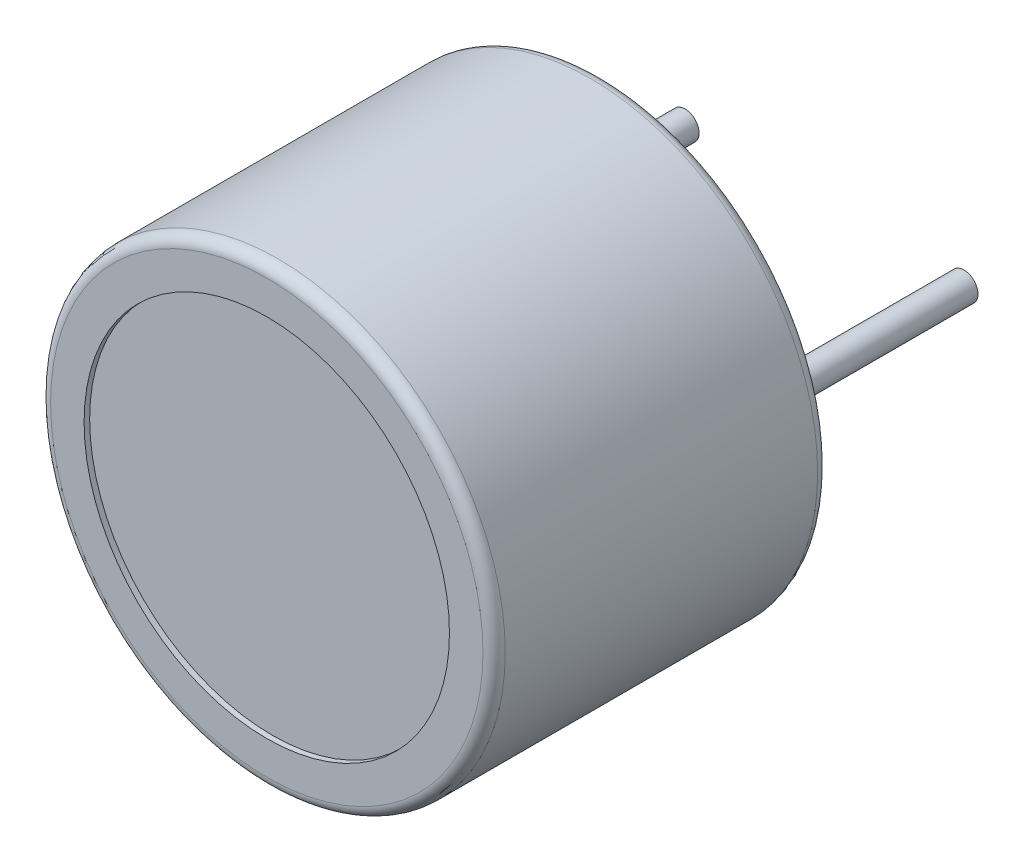
ISO-10303-21;
HEADER;
FILE_DESCRIPTION(('STEP AP214'),'2;1');
FILE_NAME('part.step','',(''),(''),'','','');
FILE_SCHEMA(('AUTOMOTIVE_DESIGN { 1 0 10303 214 1 1 1 1 }'));
ENDSEC;
DATA;
#1=APPLICATION_CONTEXT('core data for automotive mechanical design processes');
#2=APPLICATION_PROTOCOL_DEFINITION('international standard','automotive_design',2000,#1);
#3=PRODUCT_CONTEXT('',#1,'mechanical');
#4=PRODUCT('Part','Part','',(#3));
#5=PRODUCT_RELATED_PRODUCT_CATEGORY('part','',(#4));
#6=PRODUCT_DEFINITION_FORMATION('','',#4);
#7=PRODUCT_DEFINITION_CONTEXT('part definition',#1,'design');
#8=PRODUCT_DEFINITION('design','',#6,#7);
#9=PRODUCT_DEFINITION_SHAPE('','',#8);
#10=(LENGTH_UNIT() NAMED_UNIT(*) SI_UNIT(.MILLI.,.METRE.));
#11=(NAMED_UNIT(*) PLANE_ANGLE_UNIT() SI_UNIT($,.RADIAN.));
#12=(NAMED_UNIT(*) SI_UNIT($,.STERADIAN.) SOLID_ANGLE_UNIT());
#13=UNCERTAINTY_MEASURE_WITH_UNIT(LENGTH_MEASURE(1.E-05),#10,'distance_accuracy_value','');
#14=(GEOMETRIC_REPRESENTATION_CONTEXT(3) GLOBAL_UNCERTAINTY_ASSIGNED_CONTEXT((#13)) GLOBAL_UNIT_ASSIGNED_CONTEXT((#10,
#11,#12)) REPRESENTATION_CONTEXT('',''));
#15=CARTESIAN_POINT('',(0.,0.,0.));
#16=DIRECTION('',(0.,0.,1.));
#17=DIRECTION('',(1.,0.,0.));
#18=AXIS2_PLACEMENT_3D('',#15,#16,#17);
#19=CARTESIAN_POINT('',(0.,0.,0.));
#20=DIRECTION('',(0.,0.,1.));
#21=DIRECTION('',(1.,0.,0.));
#22=AXIS2_PLACEMENT_3D('',#19,#20,#21);
#23=PLANE('',#22);
#24=CARTESIAN_POINT('',(-5.,0.,0.));
#25=DIRECTION('',(0.,0.,1.));
#26=DIRECTION('',(1.,0.,0.));
#27=AXIS2_PLACEMENT_3D('',#24,#25,#26);
#28=CIRCLE('',#27,0.9);
#29=CARTESIAN_POINT('',(-4.1,0.,0.));
#30=VERTEX_POINT('',#29);
#31=EDGE_CURVE('E50',#30,#30,#28,.T.);
#32=ORIENTED_EDGE('',*,*,#31,.T.);
#33=EDGE_LOOP('',(#32));
#34=FACE_BOUND('',#33,.T.);
#35=CARTESIAN_POINT('',(5.,0.,0.));
#36=DIRECTION('',(0.,0.,1.));
#37=DIRECTION('',(1.,0.,0.));
#38=AXIS2_PLACEMENT_3D('',#35,#36,#37);
#39=CIRCLE('',#38,0.9);
#40=CARTESIAN_POINT('',(5.9,0.,0.));
#41=VERTEX_POINT('',#40);
#42=EDGE_CURVE('E53',#41,#41,#39,.T.);
#43=ORIENTED_EDGE('',*,*,#42,.T.);
#44=EDGE_LOOP('',(#43));
#45=FACE_BOUND('',#44,.T.);
#46=CARTESIAN_POINT('',(0.,0.,0.));
#47=DIRECTION('',(0.,0.,1.));
#48=DIRECTION('',(1.,0.,0.));
#49=AXIS2_PLACEMENT_3D('',#46,#47,#48);
#50=CIRCLE('',#49,7.75);
#51=CARTESIAN_POINT('',(7.75,0.,0.));
#52=VERTEX_POINT('',#51);
#53=EDGE_CURVE('E56',#52,#52,#50,.F.);
#54=ORIENTED_EDGE('',*,*,#53,.T.);
#55=EDGE_LOOP('',(#54));
#56=FACE_BOUND('',#55,.T.);
#57=ADVANCED_FACE('F30',(#34,#45,#56),#23,.F.);
#58=CARTESIAN_POINT('',(0.,0.,12.));
#59=DIRECTION('',(0.,0.,-1.));
#60=DIRECTION('',(-1.,0.,0.));
#61=AXIS2_PLACEMENT_3D('',#58,#59,#60);
#62=CYLINDRICAL_SURFACE('',#61,8.15);
#63=CARTESIAN_POINT('',(0.,0.,0.399999999999999));
#64=DIRECTION('',(0.,0.,1.));
#65=DIRECTION('',(1.,0.,0.));
#66=AXIS2_PLACEMENT_3D('',#63,#64,#65);
#67=CIRCLE('',#66,8.15);
#68=CARTESIAN_POINT('',(8.15,0.,0.399999999999999));
#69=VERTEX_POINT('',#68);
#70=EDGE_CURVE('E37',#69,#69,#67,.T.);
#71=ORIENTED_EDGE('',*,*,#70,.T.);
#72=EDGE_LOOP('',(#71));
#73=FACE_BOUND('',#72,.T.);
#74=CARTESIAN_POINT('',(0.,0.,11.6));
#75=DIRECTION('',(0.,0.,1.));
#76=DIRECTION('',(1.,0.,0.));
#77=AXIS2_PLACEMENT_3D('',#74,#75,#76);
#78=CIRCLE('',#77,8.15);
#79=CARTESIAN_POINT('',(8.15,0.,11.6));
#80=VERTEX_POINT('',#79);
#81=EDGE_CURVE('E41',#80,#80,#78,.F.);
#82=ORIENTED_EDGE('',*,*,#81,.T.);
#83=EDGE_LOOP('',(#82));
#84=FACE_BOUND('',#83,.T.);
#85=ADVANCED_FACE('F86',(#73,#84),#62,.T.);
#86=CARTESIAN_POINT('',(0.,0.,12.));
#87=DIRECTION('',(0.,0.,1.));
#88=DIRECTION('',(1.,0.,0.));
#89=AXIS2_PLACEMENT_3D('',#86,#87,#88);
#90=PLANE('',#89);
#91=CARTESIAN_POINT('',(0.,0.,12.));
#92=DIRECTION('',(0.,0.,1.));
#93=DIRECTION('',(1.,0.,0.));
#94=AXIS2_PLACEMENT_3D('',#91,#92,#93);
#95=CIRCLE('',#94,6.55);
#96=CARTESIAN_POINT('',(6.55,0.,12.));
#97=VERTEX_POINT('',#96);
#98=EDGE_CURVE('E69',#97,#97,#95,.T.);
#99=ORIENTED_EDGE('',*,*,#98,.F.);
#100=EDGE_LOOP('',(#99));
#101=FACE_BOUND('',#100,.T.);
#102=CARTESIAN_POINT('',(0.,0.,12.));
#103=DIRECTION('',(0.,0.,1.));
#104=DIRECTION('',(1.,0.,0.));
#105=AXIS2_PLACEMENT_3D('',#102,#103,#104);
#106=CIRCLE('',#105,7.75);
#107=CARTESIAN_POINT('',(7.75,0.,12.));
#108=VERTEX_POINT('',#107);
#109=EDGE_CURVE('E10',#108,#108,#106,.T.);
#110=ORIENTED_EDGE('',*,*,#109,.T.);
#111=EDGE_LOOP('',(#110));
#112=FACE_BOUND('',#111,.T.);
#113=ADVANCED_FACE('F83',(#101,#112),#90,.T.);
#114=CARTESIAN_POINT('',(5.,0.,-8.));
#115=DIRECTION('',(0.,0.,1.));
#116=DIRECTION('',(1.,0.,0.));
#117=AXIS2_PLACEMENT_3D('',#114,#115,#116);
#118=CYLINDRICAL_SURFACE('',#117,0.5);
#119=CARTESIAN_POINT('',(5.,0.,-0.4));
#120=DIRECTION('',(0.,0.,1.));
#121=DIRECTION('',(1.,0.,0.));
#122=AXIS2_PLACEMENT_3D('',#119,#120,#121);
#123=CIRCLE('',#122,0.5);
#124=CARTESIAN_POINT('',(5.5,0.,-0.4));
#125=VERTEX_POINT('',#124);
#126=EDGE_CURVE('E45',#125,#125,#123,.F.);
#127=ORIENTED_EDGE('',*,*,#126,.T.);
#128=EDGE_LOOP('',(#127));
#129=FACE_BOUND('',#128,.T.);
#130=CARTESIAN_POINT('',(5.,0.,-8.));
#131=DIRECTION('',(0.,0.,-1.));
#132=DIRECTION('',(-1.,0.,0.));
#133=AXIS2_PLACEMENT_3D('',#130,#131,#132);
#134=CIRCLE('',#133,0.5);
#135=CARTESIAN_POINT('',(4.5,0.,-8.));
#136=VERTEX_POINT('',#135);
#137=EDGE_CURVE('E62',#136,#136,#134,.T.);
#138=ORIENTED_EDGE('',*,*,#137,.F.);
#139=EDGE_LOOP('',(#138));
#140=FACE_BOUND('',#139,.T.);
#141=ADVANCED_FACE('F85',(#129,#140),#118,.T.);
#142=CARTESIAN_POINT('',(5.,0.,-8.));
#143=DIRECTION('',(0.,0.,-1.));
#144=DIRECTION('',(-1.,0.,0.));
#145=AXIS2_PLACEMENT_3D('',#142,#143,#144);
#146=PLANE('',#145);
#147=ORIENTED_EDGE('',*,*,#137,.T.);
#148=EDGE_LOOP('',(#147));
#149=FACE_BOUND('',#148,.T.);
#150=ADVANCED_FACE('F92',(#149),#146,.T.);
#151=CARTESIAN_POINT('',(-5.,0.,-8.));
#152=DIRECTION('',(0.,0.,1.));
#153=DIRECTION('',(1.,0.,0.));
#154=AXIS2_PLACEMENT_3D('',#151,#152,#153);
#155=CYLINDRICAL_SURFACE('',#154,0.5);
#156=CARTESIAN_POINT('',(-5.,0.,-0.4));
#157=DIRECTION('',(0.,0.,1.));
#158=DIRECTION('',(1.,0.,0.));
#159=AXIS2_PLACEMENT_3D('',#156,#157,#158);
#160=CIRCLE('',#159,0.5);
#161=CARTESIAN_POINT('',(-4.5,0.,-0.4));
#162=VERTEX_POINT('',#161);
#163=EDGE_CURVE('E59',#162,#162,#160,.F.);
#164=ORIENTED_EDGE('',*,*,#163,.T.);
#165=EDGE_LOOP('',(#164));
#166=FACE_BOUND('',#165,.T.);
#167=CARTESIAN_POINT('',(-5.,0.,-8.));
#168=DIRECTION('',(0.,0.,-1.));
#169=DIRECTION('',(1.,0.,0.));
#170=AXIS2_PLACEMENT_3D('',#167,#168,#169);
#171=CIRCLE('',#170,0.5);
#172=CARTESIAN_POINT('',(-4.5,0.,-8.));
#173=VERTEX_POINT('',#172);
#174=EDGE_CURVE('E65',#173,#173,#171,.T.);
#175=ORIENTED_EDGE('',*,*,#174,.F.);
#176=EDGE_LOOP('',(#175));
#177=FACE_BOUND('',#176,.T.);
#178=ADVANCED_FACE('F165',(#166,#177),#155,.T.);
#179=CARTESIAN_POINT('',(-5.,0.,-8.));
#180=DIRECTION('',(0.,0.,1.));
#181=DIRECTION('',(1.,0.,0.));
#182=AXIS2_PLACEMENT_3D('',#179,#180,#181);
#183=PLANE('',#182);
#184=ORIENTED_EDGE('',*,*,#174,.T.);
#185=EDGE_LOOP('',(#184));
#186=FACE_BOUND('',#185,.T.);
#187=ADVANCED_FACE('F107',(#186),#183,.F.);
#188=CARTESIAN_POINT('',(-5.,0.,-0.4));
#189=DIRECTION('',(0.,0.,1.));
#190=DIRECTION('',(1.,0.,0.));
#191=AXIS2_PLACEMENT_3D('',#188,#189,#190);
#192=TOROIDAL_SURFACE('',#191,0.9,0.4);
#193=ORIENTED_EDGE('',*,*,#31,.F.);
#194=EDGE_LOOP('',(#193));
#195=FACE_BOUND('',#194,.T.);
#196=ORIENTED_EDGE('',*,*,#163,.F.);
#197=EDGE_LOOP('',(#196));
#198=FACE_BOUND('',#197,.T.);
#199=ADVANCED_FACE('F103',(#195,#198),#192,.F.);
#200=CARTESIAN_POINT('',(5.,0.,-0.4));
#201=DIRECTION('',(0.,0.,1.));
#202=DIRECTION('',(1.,0.,0.));
#203=AXIS2_PLACEMENT_3D('',#200,#201,#202);
#204=TOROIDAL_SURFACE('',#203,0.9,0.4);
#205=ORIENTED_EDGE('',*,*,#42,.F.);
#206=EDGE_LOOP('',(#205));
#207=FACE_BOUND('',#206,.T.);
#208=ORIENTED_EDGE('',*,*,#126,.F.);
#209=EDGE_LOOP('',(#208));
#210=FACE_BOUND('',#209,.T.);
#211=ADVANCED_FACE('F106',(#207,#210),#204,.F.);
#212=CARTESIAN_POINT('',(0.,0.,0.399999999999999));
#213=DIRECTION('',(0.,0.,1.));
#214=DIRECTION('',(1.,0.,0.));
#215=AXIS2_PLACEMENT_3D('',#212,#213,#214);
#216=TOROIDAL_SURFACE('',#215,7.75,0.4);
#217=ORIENTED_EDGE('',*,*,#53,.F.);
#218=EDGE_LOOP('',(#217));
#219=FACE_BOUND('',#218,.T.);
#220=ORIENTED_EDGE('',*,*,#70,.F.);
#221=EDGE_LOOP('',(#220));
#222=FACE_BOUND('',#221,.T.);
#223=ADVANCED_FACE('F110',(#219,#222),#216,.T.);
#224=CARTESIAN_POINT('',(0.,0.,11.6));
#225=DIRECTION('',(0.,0.,1.));
#226=DIRECTION('',(1.,0.,0.));
#227=AXIS2_PLACEMENT_3D('',#224,#225,#226);
#228=TOROIDAL_SURFACE('',#227,7.75,0.4);
#229=ORIENTED_EDGE('',*,*,#81,.F.);
#230=EDGE_LOOP('',(#229));
#231=FACE_BOUND('',#230,.T.);
#232=ORIENTED_EDGE('',*,*,#109,.F.);
#233=EDGE_LOOP('',(#232));
#234=FACE_BOUND('',#233,.T.);
#235=ADVANCED_FACE('F32',(#231,#234),#228,.T.);
#236=CARTESIAN_POINT('',(0.,0.,11.8));
#237=DIRECTION('',(0.,0.,1.));
#238=DIRECTION('',(1.,0.,0.));
#239=AXIS2_PLACEMENT_3D('',#236,#237,#238);
#240=CYLINDRICAL_SURFACE('',#239,6.55);
#241=CARTESIAN_POINT('',(0.,0.,11.8));
#242=DIRECTION('',(0.,0.,1.));
#243=DIRECTION('',(1.,0.,0.));
#244=AXIS2_PLACEMENT_3D('',#241,#242,#243);
#245=CIRCLE('',#244,6.55);
#246=CARTESIAN_POINT('',(6.55,0.,11.8));
#247=VERTEX_POINT('',#246);
#248=EDGE_CURVE('E68',#247,#247,#245,.T.);
#249=ORIENTED_EDGE('',*,*,#248,.F.);
#250=EDGE_LOOP('',(#249));
#251=FACE_BOUND('',#250,.T.);
#252=ORIENTED_EDGE('',*,*,#98,.T.);
#253=EDGE_LOOP('',(#252));
#254=FACE_BOUND('',#253,.T.);
#255=ADVANCED_FACE('F77',(#251,#254),#240,.F.);
#256=CARTESIAN_POINT('',(0.,0.,11.8));
#257=DIRECTION('',(0.,0.,1.));
#258=DIRECTION('',(1.,0.,0.));
#259=AXIS2_PLACEMENT_3D('',#256,#257,#258);
#260=PLANE('',#259);
#261=ORIENTED_EDGE('',*,*,#248,.T.);
#262=EDGE_LOOP('',(#261));
#263=FACE_BOUND('',#262,.T.);
#264=ADVANCED_FACE('F75',(#263),#260,.T.);
#265=CLOSED_SHELL('',(#57,#85,#113,#141,#150,#178,#187,#199,#211,#223,#235,#255,#264));
#266=MANIFOLD_SOLID_BREP('B2',#265);
#267=ADVANCED_BREP_SHAPE_REPRESENTATION('',(#18,#266),#14);
#268=SHAPE_DEFINITION_REPRESENTATION(#9,#267);
ENDSEC;
END-ISO-10303-21;
